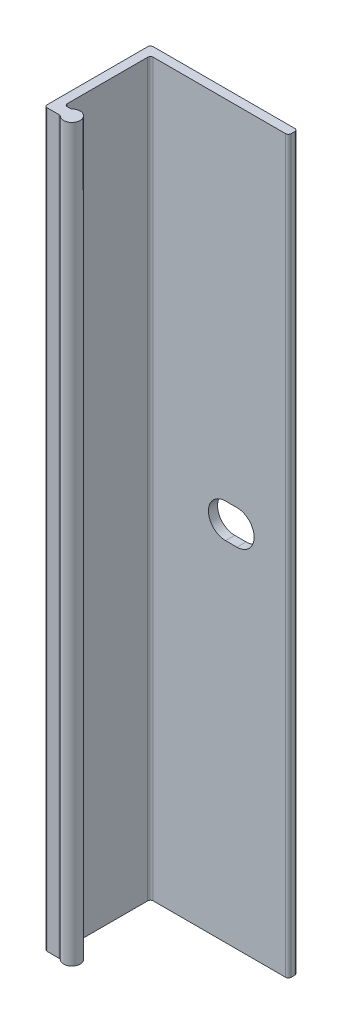
ISO-10303-21;
HEADER;
FILE_DESCRIPTION(('STEP AP214'),'2;1');
FILE_NAME('part.step','',(''),(''),'','','');
FILE_SCHEMA(('AUTOMOTIVE_DESIGN { 1 0 10303 214 1 1 1 1 }'));
ENDSEC;
DATA;
#1=APPLICATION_CONTEXT('core data for automotive mechanical design processes');
#2=APPLICATION_PROTOCOL_DEFINITION('international standard','automotive_design',2000,#1);
#3=PRODUCT_CONTEXT('',#1,'mechanical');
#4=PRODUCT('Part','Part','',(#3));
#5=PRODUCT_RELATED_PRODUCT_CATEGORY('part','',(#4));
#6=PRODUCT_DEFINITION_FORMATION('','',#4);
#7=PRODUCT_DEFINITION_CONTEXT('part definition',#1,'design');
#8=PRODUCT_DEFINITION('design','',#6,#7);
#9=PRODUCT_DEFINITION_SHAPE('','',#8);
#10=(LENGTH_UNIT() NAMED_UNIT(*) SI_UNIT(.MILLI.,.METRE.));
#11=(NAMED_UNIT(*) PLANE_ANGLE_UNIT() SI_UNIT($,.RADIAN.));
#12=(NAMED_UNIT(*) SI_UNIT($,.STERADIAN.) SOLID_ANGLE_UNIT());
#13=UNCERTAINTY_MEASURE_WITH_UNIT(LENGTH_MEASURE(1.E-05),#10,'distance_accuracy_value','');
#14=(GEOMETRIC_REPRESENTATION_CONTEXT(3) GLOBAL_UNCERTAINTY_ASSIGNED_CONTEXT((#13)) GLOBAL_UNIT_ASSIGNED_CONTEXT((#10,
#11,#12)) REPRESENTATION_CONTEXT('',''));
#15=CARTESIAN_POINT('',(0.,0.,0.));
#16=DIRECTION('',(0.,0.,1.));
#17=DIRECTION('',(1.,0.,0.));
#18=AXIS2_PLACEMENT_3D('',#15,#16,#17);
#19=CARTESIAN_POINT('',(0.381000000000002,50.8,14.351));
#20=DIRECTION('',(0.,-1.,0.));
#21=DIRECTION('',(0.,0.,-1.));
#22=AXIS2_PLACEMENT_3D('',#19,#20,#21);
#23=CYLINDRICAL_SURFACE('',#22,0.381);
#24=CARTESIAN_POINT('',(0.381000000000002,-50.8,14.351));
#25=DIRECTION('',(0.,1.,0.));
#26=DIRECTION('',(0.,0.,-1.));
#27=AXIS2_PLACEMENT_3D('',#24,#25,#26);
#28=CIRCLE('',#27,0.381);
#29=CARTESIAN_POINT('',(0.,-50.8,14.351));
#30=VERTEX_POINT('',#29);
#31=CARTESIAN_POINT('',(0.381000000000002,-50.8,14.732));
#32=VERTEX_POINT('',#31);
#33=EDGE_CURVE('E203',#30,#32,#28,.T.);
#34=ORIENTED_EDGE('',*,*,#33,.T.);
#35=DIRECTION('',(0.,-1.,0.));
#36=VECTOR('',#35,1.);
#37=CARTESIAN_POINT('',(0.381000000000002,50.8,14.732));
#38=LINE('',#37,#36);
#39=CARTESIAN_POINT('',(0.381000000000002,50.8,14.732));
#40=VERTEX_POINT('',#39);
#41=EDGE_CURVE('E11',#40,#32,#38,.T.);
#42=ORIENTED_EDGE('',*,*,#41,.F.);
#43=CARTESIAN_POINT('',(0.381000000000002,50.8,14.351));
#44=DIRECTION('',(0.,1.,0.));
#45=DIRECTION('',(0.,0.,-1.));
#46=AXIS2_PLACEMENT_3D('',#43,#44,#45);
#47=CIRCLE('',#46,0.381);
#48=CARTESIAN_POINT('',(0.,50.8,14.351));
#49=VERTEX_POINT('',#48);
#50=EDGE_CURVE('E207',#49,#40,#47,.T.);
#51=ORIENTED_EDGE('',*,*,#50,.F.);
#52=DIRECTION('',(0.,-1.,0.));
#53=VECTOR('',#52,1.);
#54=CARTESIAN_POINT('',(0.,50.8,14.351));
#55=LINE('',#54,#53);
#56=EDGE_CURVE('E241',#49,#30,#55,.T.);
#57=ORIENTED_EDGE('',*,*,#56,.T.);
#58=EDGE_LOOP('',(#34,#42,#51,#57));
#59=FACE_BOUND('',#58,.T.);
#60=ADVANCED_FACE('F34',(#59),#23,.T.);
#61=CARTESIAN_POINT('',(0.381000000000002,50.8,14.732));
#62=DIRECTION('',(0.,0.,-1.));
#63=DIRECTION('',(-1.,0.,0.));
#64=AXIS2_PLACEMENT_3D('',#61,#62,#63);
#65=PLANE('',#64);
#66=DIRECTION('',(1.,0.,0.));
#67=VECTOR('',#66,1.);
#68=CARTESIAN_POINT('',(0.381000000000002,-50.8,14.732));
#69=LINE('',#68,#67);
#70=CARTESIAN_POINT('',(2.03996875048439,-50.8,14.732));
#71=VERTEX_POINT('',#70);
#72=EDGE_CURVE('E244',#32,#71,#69,.T.);
#73=ORIENTED_EDGE('',*,*,#72,.T.);
#74=DIRECTION('',(0.,-1.,0.));
#75=VECTOR('',#74,1.);
#76=CARTESIAN_POINT('',(2.03996875048439,50.8,14.732));
#77=LINE('',#76,#75);
#78=CARTESIAN_POINT('',(2.03996875048439,50.8,14.732));
#79=VERTEX_POINT('',#78);
#80=EDGE_CURVE('E41',#79,#71,#77,.T.);
#81=ORIENTED_EDGE('',*,*,#80,.F.);
#82=DIRECTION('',(1.,0.,0.));
#83=VECTOR('',#82,1.);
#84=CARTESIAN_POINT('',(0.381000000000002,50.8,14.732));
#85=LINE('',#84,#83);
#86=EDGE_CURVE('E210',#40,#79,#85,.T.);
#87=ORIENTED_EDGE('',*,*,#86,.F.);
#88=ORIENTED_EDGE('',*,*,#41,.T.);
#89=EDGE_LOOP('',(#73,#81,#87,#88));
#90=FACE_BOUND('',#89,.T.);
#91=ADVANCED_FACE('F341',(#90),#65,.F.);
#92=CARTESIAN_POINT('',(2.03996875048439,50.8,15.113));
#93=DIRECTION('',(0.,-1.,0.));
#94=DIRECTION('',(0.,0.,-1.));
#95=AXIS2_PLACEMENT_3D('',#92,#93,#94);
#96=CYLINDRICAL_SURFACE('',#95,0.380999999999999);
#97=CARTESIAN_POINT('',(2.03996875048439,-50.8,15.113));
#98=DIRECTION('',(0.,-1.,0.));
#99=DIRECTION('',(0.,0.,-1.));
#100=AXIS2_PLACEMENT_3D('',#97,#98,#99);
#101=CIRCLE('',#100,0.380999999999999);
#102=CARTESIAN_POINT('',(2.29197656286329,-50.8,14.82725));
#103=VERTEX_POINT('',#102);
#104=EDGE_CURVE('E246',#71,#103,#101,.T.);
#105=ORIENTED_EDGE('',*,*,#104,.T.);
#106=DIRECTION('',(0.,-1.,0.));
#107=VECTOR('',#106,1.);
#108=CARTESIAN_POINT('',(2.29197656286329,50.8,14.82725));
#109=LINE('',#108,#107);
#110=CARTESIAN_POINT('',(2.29197656286329,50.8,14.82725));
#111=VERTEX_POINT('',#110);
#112=EDGE_CURVE('E311',#111,#103,#109,.T.);
#113=ORIENTED_EDGE('',*,*,#112,.F.);
#114=CARTESIAN_POINT('',(2.03996875048439,50.8,15.113));
#115=DIRECTION('',(0.,-1.,0.));
#116=DIRECTION('',(0.,0.,-1.));
#117=AXIS2_PLACEMENT_3D('',#114,#115,#116);
#118=CIRCLE('',#117,0.380999999999999);
#119=EDGE_CURVE('E213',#79,#111,#118,.T.);
#120=ORIENTED_EDGE('',*,*,#119,.F.);
#121=ORIENTED_EDGE('',*,*,#80,.T.);
#122=EDGE_LOOP('',(#105,#113,#120,#121));
#123=FACE_BOUND('',#122,.T.);
#124=ADVANCED_FACE('F318',(#123),#96,.F.);
#125=CARTESIAN_POINT('',(3.048,50.8,13.97));
#126=DIRECTION('',(0.,-1.,0.));
#127=DIRECTION('',(0.,0.,-1.));
#128=AXIS2_PLACEMENT_3D('',#125,#126,#127);
#129=CYLINDRICAL_SURFACE('',#128,1.143);
#130=CARTESIAN_POINT('',(3.048,-50.8,13.97));
#131=DIRECTION('',(0.,1.,0.));
#132=DIRECTION('',(0.,0.,1.));
#133=AXIS2_PLACEMENT_3D('',#130,#131,#132);
#134=CIRCLE('',#133,1.143);
#135=CARTESIAN_POINT('',(2.29197656286329,-50.8,13.11275));
#136=VERTEX_POINT('',#135);
#137=EDGE_CURVE('E248',#103,#136,#134,.T.);
#138=ORIENTED_EDGE('',*,*,#137,.T.);
#139=DIRECTION('',(0.,-1.,0.));
#140=VECTOR('',#139,1.);
#141=CARTESIAN_POINT('',(2.29197656286329,50.8,13.11275));
#142=LINE('',#141,#140);
#143=CARTESIAN_POINT('',(2.29197656286329,50.8,13.11275));
#144=VERTEX_POINT('',#143);
#145=EDGE_CURVE('E308',#144,#136,#142,.T.);
#146=ORIENTED_EDGE('',*,*,#145,.F.);
#147=CARTESIAN_POINT('',(3.048,50.8,13.97));
#148=DIRECTION('',(0.,1.,0.));
#149=DIRECTION('',(0.,0.,1.));
#150=AXIS2_PLACEMENT_3D('',#147,#148,#149);
#151=CIRCLE('',#150,1.143);
#152=EDGE_CURVE('E215',#111,#144,#151,.T.);
#153=ORIENTED_EDGE('',*,*,#152,.F.);
#154=ORIENTED_EDGE('',*,*,#112,.T.);
#155=EDGE_LOOP('',(#138,#146,#153,#154));
#156=FACE_BOUND('',#155,.T.);
#157=ADVANCED_FACE('F329',(#156),#129,.T.);
#158=CARTESIAN_POINT('',(2.03996875048439,50.8,12.827));
#159=DIRECTION('',(0.,-1.,0.));
#160=DIRECTION('',(0.,0.,-1.));
#161=AXIS2_PLACEMENT_3D('',#158,#159,#160);
#162=CYLINDRICAL_SURFACE('',#161,0.381000000000001);
#163=CARTESIAN_POINT('',(2.03996875048439,-50.8,12.827));
#164=DIRECTION('',(0.,-1.,0.));
#165=DIRECTION('',(0.,0.,-1.));
#166=AXIS2_PLACEMENT_3D('',#163,#164,#165);
#167=CIRCLE('',#166,0.381000000000001);
#168=CARTESIAN_POINT('',(2.03996875048439,-50.8,13.208));
#169=VERTEX_POINT('',#168);
#170=EDGE_CURVE('E250',#136,#169,#167,.T.);
#171=ORIENTED_EDGE('',*,*,#170,.T.);
#172=DIRECTION('',(0.,-1.,0.));
#173=VECTOR('',#172,1.);
#174=CARTESIAN_POINT('',(2.03996875048439,50.8,13.208));
#175=LINE('',#174,#173);
#176=CARTESIAN_POINT('',(2.03996875048439,50.8,13.208));
#177=VERTEX_POINT('',#176);
#178=EDGE_CURVE('E305',#177,#169,#175,.T.);
#179=ORIENTED_EDGE('',*,*,#178,.F.);
#180=CARTESIAN_POINT('',(2.03996875048439,50.8,12.827));
#181=DIRECTION('',(0.,-1.,0.));
#182=DIRECTION('',(0.,0.,-1.));
#183=AXIS2_PLACEMENT_3D('',#180,#181,#182);
#184=CIRCLE('',#183,0.381000000000001);
#185=EDGE_CURVE('E217',#144,#177,#184,.T.);
#186=ORIENTED_EDGE('',*,*,#185,.F.);
#187=ORIENTED_EDGE('',*,*,#145,.T.);
#188=EDGE_LOOP('',(#171,#179,#186,#187));
#189=FACE_BOUND('',#188,.T.);
#190=ADVANCED_FACE('F333',(#189),#162,.F.);
#191=CARTESIAN_POINT('',(1.65099999999999,50.8,13.208));
#192=DIRECTION('',(0.,0.,1.));
#193=DIRECTION('',(1.,0.,0.));
#194=AXIS2_PLACEMENT_3D('',#191,#192,#193);
#195=PLANE('',#194);
#196=DIRECTION('',(-1.,0.,0.));
#197=VECTOR('',#196,1.);
#198=CARTESIAN_POINT('',(1.65099999999999,-50.8,13.208));
#199=LINE('',#198,#197);
#200=CARTESIAN_POINT('',(1.65099999999999,-50.8,13.208));
#201=VERTEX_POINT('',#200);
#202=EDGE_CURVE('E252',#169,#201,#199,.T.);
#203=ORIENTED_EDGE('',*,*,#202,.T.);
#204=DIRECTION('',(0.,-1.,0.));
#205=VECTOR('',#204,1.);
#206=CARTESIAN_POINT('',(1.65099999999999,50.8,13.208));
#207=LINE('',#206,#205);
#208=CARTESIAN_POINT('',(1.65099999999999,50.8,13.208));
#209=VERTEX_POINT('',#208);
#210=EDGE_CURVE('E302',#209,#201,#207,.T.);
#211=ORIENTED_EDGE('',*,*,#210,.F.);
#212=DIRECTION('',(-1.,0.,0.));
#213=VECTOR('',#212,1.);
#214=CARTESIAN_POINT('',(1.65099999999999,50.8,13.208));
#215=LINE('',#214,#213);
#216=EDGE_CURVE('E219',#177,#209,#215,.T.);
#217=ORIENTED_EDGE('',*,*,#216,.F.);
#218=ORIENTED_EDGE('',*,*,#178,.T.);
#219=EDGE_LOOP('',(#203,#211,#217,#218));
#220=FACE_BOUND('',#219,.T.);
#221=ADVANCED_FACE('F392',(#220),#195,.F.);
#222=CARTESIAN_POINT('',(1.65099999999999,50.8,12.827));
#223=DIRECTION('',(0.,-1.,0.));
#224=DIRECTION('',(0.,0.,-1.));
#225=AXIS2_PLACEMENT_3D('',#222,#223,#224);
#226=CYLINDRICAL_SURFACE('',#225,0.381);
#227=CARTESIAN_POINT('',(1.65099999999999,-50.8,12.827));
#228=DIRECTION('',(0.,-1.,0.));
#229=DIRECTION('',(0.,0.,1.));
#230=AXIS2_PLACEMENT_3D('',#227,#228,#229);
#231=CIRCLE('',#230,0.381);
#232=CARTESIAN_POINT('',(1.26999999999999,-50.8,12.827));
#233=VERTEX_POINT('',#232);
#234=EDGE_CURVE('E254',#201,#233,#231,.T.);
#235=ORIENTED_EDGE('',*,*,#234,.T.);
#236=DIRECTION('',(0.,-1.,0.));
#237=VECTOR('',#236,1.);
#238=CARTESIAN_POINT('',(1.26999999999999,50.8,12.827));
#239=LINE('',#238,#237);
#240=CARTESIAN_POINT('',(1.26999999999999,50.8,12.827));
#241=VERTEX_POINT('',#240);
#242=EDGE_CURVE('E299',#241,#233,#239,.T.);
#243=ORIENTED_EDGE('',*,*,#242,.F.);
#244=CARTESIAN_POINT('',(1.65099999999999,50.8,12.827));
#245=DIRECTION('',(0.,-1.,0.));
#246=DIRECTION('',(0.,0.,1.));
#247=AXIS2_PLACEMENT_3D('',#244,#245,#246);
#248=CIRCLE('',#247,0.381);
#249=EDGE_CURVE('E221',#209,#241,#248,.T.);
#250=ORIENTED_EDGE('',*,*,#249,.F.);
#251=ORIENTED_EDGE('',*,*,#210,.T.);
#252=EDGE_LOOP('',(#235,#243,#250,#251));
#253=FACE_BOUND('',#252,.T.);
#254=ADVANCED_FACE('F389',(#253),#226,.F.);
#255=CARTESIAN_POINT('',(1.27,50.8,1.651));
#256=DIRECTION('',(-1.,0.,0.));
#257=DIRECTION('',(0.,0.,1.));
#258=AXIS2_PLACEMENT_3D('',#255,#256,#257);
#259=PLANE('',#258);
#260=DIRECTION('',(0.,0.,-1.));
#261=VECTOR('',#260,1.);
#262=CARTESIAN_POINT('',(1.27,-50.8,1.651));
#263=LINE('',#262,#261);
#264=CARTESIAN_POINT('',(1.27,-50.8,1.651));
#265=VERTEX_POINT('',#264);
#266=EDGE_CURVE('E256',#233,#265,#263,.T.);
#267=ORIENTED_EDGE('',*,*,#266,.T.);
#268=DIRECTION('',(0.,-1.,0.));
#269=VECTOR('',#268,1.);
#270=CARTESIAN_POINT('',(1.27,50.8,1.651));
#271=LINE('',#270,#269);
#272=CARTESIAN_POINT('',(1.27,50.8,1.651));
#273=VERTEX_POINT('',#272);
#274=EDGE_CURVE('E296',#273,#265,#271,.T.);
#275=ORIENTED_EDGE('',*,*,#274,.F.);
#276=DIRECTION('',(0.,0.,-1.));
#277=VECTOR('',#276,1.);
#278=CARTESIAN_POINT('',(1.27,50.8,1.651));
#279=LINE('',#278,#277);
#280=EDGE_CURVE('E223',#241,#273,#279,.T.);
#281=ORIENTED_EDGE('',*,*,#280,.F.);
#282=ORIENTED_EDGE('',*,*,#242,.T.);
#283=EDGE_LOOP('',(#267,#275,#281,#282));
#284=FACE_BOUND('',#283,.T.);
#285=ADVANCED_FACE('F385',(#284),#259,.F.);
#286=CARTESIAN_POINT('',(1.651,50.8,1.651));
#287=DIRECTION('',(0.,-1.,0.));
#288=DIRECTION('',(0.,0.,-1.));
#289=AXIS2_PLACEMENT_3D('',#286,#287,#288);
#290=CYLINDRICAL_SURFACE('',#289,0.381);
#291=CARTESIAN_POINT('',(1.651,-50.8,1.651));
#292=DIRECTION('',(0.,-1.,0.));
#293=DIRECTION('',(0.,0.,1.));
#294=AXIS2_PLACEMENT_3D('',#291,#292,#293);
#295=CIRCLE('',#294,0.381);
#296=CARTESIAN_POINT('',(1.651,-50.8,1.27));
#297=VERTEX_POINT('',#296);
#298=EDGE_CURVE('E258',#265,#297,#295,.T.);
#299=ORIENTED_EDGE('',*,*,#298,.T.);
#300=DIRECTION('',(0.,-1.,0.));
#301=VECTOR('',#300,1.);
#302=CARTESIAN_POINT('',(1.651,50.8,1.27));
#303=LINE('',#302,#301);
#304=CARTESIAN_POINT('',(1.651,50.8,1.27));
#305=VERTEX_POINT('',#304);
#306=EDGE_CURVE('E293',#305,#297,#303,.T.);
#307=ORIENTED_EDGE('',*,*,#306,.F.);
#308=CARTESIAN_POINT('',(1.651,50.8,1.651));
#309=DIRECTION('',(0.,-1.,0.));
#310=DIRECTION('',(0.,0.,1.));
#311=AXIS2_PLACEMENT_3D('',#308,#309,#310);
#312=CIRCLE('',#311,0.381);
#313=EDGE_CURVE('E225',#273,#305,#312,.T.);
#314=ORIENTED_EDGE('',*,*,#313,.F.);
#315=ORIENTED_EDGE('',*,*,#274,.T.);
#316=EDGE_LOOP('',(#299,#307,#314,#315));
#317=FACE_BOUND('',#316,.T.);
#318=ADVANCED_FACE('F381',(#317),#290,.F.);
#319=CARTESIAN_POINT('',(20.066,50.8,1.27));
#320=DIRECTION('',(0.,0.,-1.));
#321=DIRECTION('',(-1.,0.,0.));
#322=AXIS2_PLACEMENT_3D('',#319,#320,#321);
#323=PLANE('',#322);
#324=DIRECTION('',(1.,0.,0.));
#325=VECTOR('',#324,1.);
#326=CARTESIAN_POINT('',(11.71575,-2.38125,1.27));
#327=LINE('',#326,#325);
#328=CARTESIAN_POINT('',(11.71575,-2.38125,1.27));
#329=VERTEX_POINT('',#328);
#330=CARTESIAN_POINT('',(13.30325,-2.38125,1.27));
#331=VERTEX_POINT('',#330);
#332=EDGE_CURVE('E197',#329,#331,#327,.T.);
#333=ORIENTED_EDGE('',*,*,#332,.F.);
#334=CARTESIAN_POINT('',(11.71575,0.,1.27));
#335=DIRECTION('',(0.,0.,1.));
#336=DIRECTION('',(1.,0.,0.));
#337=AXIS2_PLACEMENT_3D('',#334,#335,#336);
#338=CIRCLE('',#337,2.38125);
#339=CARTESIAN_POINT('',(11.71575,2.38125,1.27));
#340=VERTEX_POINT('',#339);
#341=EDGE_CURVE('E48',#340,#329,#338,.T.);
#342=ORIENTED_EDGE('',*,*,#341,.F.);
#343=DIRECTION('',(-1.,0.,0.));
#344=VECTOR('',#343,1.);
#345=CARTESIAN_POINT('',(11.71575,2.38125,1.27));
#346=LINE('',#345,#344);
#347=CARTESIAN_POINT('',(13.30325,2.38125,1.27));
#348=VERTEX_POINT('',#347);
#349=EDGE_CURVE('E188',#348,#340,#346,.T.);
#350=ORIENTED_EDGE('',*,*,#349,.F.);
#351=CARTESIAN_POINT('',(13.30325,0.,1.27));
#352=DIRECTION('',(0.,0.,1.));
#353=DIRECTION('',(1.,0.,0.));
#354=AXIS2_PLACEMENT_3D('',#351,#352,#353);
#355=CIRCLE('',#354,2.38125);
#356=EDGE_CURVE('E191',#331,#348,#355,.T.);
#357=ORIENTED_EDGE('',*,*,#356,.F.);
#358=EDGE_LOOP('',(#333,#342,#350,#357));
#359=FACE_BOUND('',#358,.T.);
#360=DIRECTION('',(1.,0.,0.));
#361=VECTOR('',#360,1.);
#362=CARTESIAN_POINT('',(20.066,-50.8,1.27));
#363=LINE('',#362,#361);
#364=CARTESIAN_POINT('',(20.066,-50.8,1.27));
#365=VERTEX_POINT('',#364);
#366=EDGE_CURVE('E260',#297,#365,#363,.T.);
#367=ORIENTED_EDGE('',*,*,#366,.T.);
#368=DIRECTION('',(0.,-1.,0.));
#369=VECTOR('',#368,1.);
#370=CARTESIAN_POINT('',(20.066,50.8,1.27));
#371=LINE('',#370,#369);
#372=CARTESIAN_POINT('',(20.066,50.8,1.27));
#373=VERTEX_POINT('',#372);
#374=EDGE_CURVE('E290',#373,#365,#371,.T.);
#375=ORIENTED_EDGE('',*,*,#374,.F.);
#376=DIRECTION('',(1.,0.,0.));
#377=VECTOR('',#376,1.);
#378=CARTESIAN_POINT('',(20.066,50.8,1.27));
#379=LINE('',#378,#377);
#380=EDGE_CURVE('E227',#305,#373,#379,.T.);
#381=ORIENTED_EDGE('',*,*,#380,.F.);
#382=ORIENTED_EDGE('',*,*,#306,.T.);
#383=EDGE_LOOP('',(#367,#375,#381,#382));
#384=FACE_BOUND('',#383,.T.);
#385=ADVANCED_FACE('F376',(#359,#384),#323,.F.);
#386=CARTESIAN_POINT('',(20.066,50.8,0.889));
#387=DIRECTION('',(0.,-1.,0.));
#388=DIRECTION('',(0.,0.,-1.));
#389=AXIS2_PLACEMENT_3D('',#386,#387,#388);
#390=CYLINDRICAL_SURFACE('',#389,0.380999999999999);
#391=CARTESIAN_POINT('',(20.066,-50.8,0.889));
#392=DIRECTION('',(0.,1.,0.));
#393=DIRECTION('',(0.,0.,-1.));
#394=AXIS2_PLACEMENT_3D('',#391,#392,#393);
#395=CIRCLE('',#394,0.380999999999999);
#396=CARTESIAN_POINT('',(20.447,-50.8,0.889));
#397=VERTEX_POINT('',#396);
#398=EDGE_CURVE('E262',#365,#397,#395,.T.);
#399=ORIENTED_EDGE('',*,*,#398,.T.);
#400=DIRECTION('',(0.,-1.,0.));
#401=VECTOR('',#400,1.);
#402=CARTESIAN_POINT('',(20.447,50.8,0.889));
#403=LINE('',#402,#401);
#404=CARTESIAN_POINT('',(20.447,50.8,0.889));
#405=VERTEX_POINT('',#404);
#406=EDGE_CURVE('E287',#405,#397,#403,.T.);
#407=ORIENTED_EDGE('',*,*,#406,.F.);
#408=CARTESIAN_POINT('',(20.066,50.8,0.889));
#409=DIRECTION('',(0.,1.,0.));
#410=DIRECTION('',(0.,0.,-1.));
#411=AXIS2_PLACEMENT_3D('',#408,#409,#410);
#412=CIRCLE('',#411,0.380999999999999);
#413=EDGE_CURVE('E229',#373,#405,#412,.T.);
#414=ORIENTED_EDGE('',*,*,#413,.F.);
#415=ORIENTED_EDGE('',*,*,#374,.T.);
#416=EDGE_LOOP('',(#399,#407,#414,#415));
#417=FACE_BOUND('',#416,.T.);
#418=ADVANCED_FACE('F370',(#417),#390,.T.);
#419=CARTESIAN_POINT('',(20.447,50.8,0.381));
#420=DIRECTION('',(-1.,0.,0.));
#421=DIRECTION('',(0.,0.,1.));
#422=AXIS2_PLACEMENT_3D('',#419,#420,#421);
#423=PLANE('',#422);
#424=DIRECTION('',(0.,0.,-1.));
#425=VECTOR('',#424,1.);
#426=CARTESIAN_POINT('',(20.447,-50.8,0.381));
#427=LINE('',#426,#425);
#428=CARTESIAN_POINT('',(20.447,-50.8,0.381));
#429=VERTEX_POINT('',#428);
#430=EDGE_CURVE('E264',#397,#429,#427,.T.);
#431=ORIENTED_EDGE('',*,*,#430,.T.);
#432=DIRECTION('',(0.,-1.,0.));
#433=VECTOR('',#432,1.);
#434=CARTESIAN_POINT('',(20.447,50.8,0.381));
#435=LINE('',#434,#433);
#436=CARTESIAN_POINT('',(20.447,50.8,0.381));
#437=VERTEX_POINT('',#436);
#438=EDGE_CURVE('E284',#437,#429,#435,.T.);
#439=ORIENTED_EDGE('',*,*,#438,.F.);
#440=DIRECTION('',(0.,0.,-1.));
#441=VECTOR('',#440,1.);
#442=CARTESIAN_POINT('',(20.447,50.8,0.381));
#443=LINE('',#442,#441);
#444=EDGE_CURVE('E231',#405,#437,#443,.T.);
#445=ORIENTED_EDGE('',*,*,#444,.F.);
#446=ORIENTED_EDGE('',*,*,#406,.T.);
#447=EDGE_LOOP('',(#431,#439,#445,#446));
#448=FACE_BOUND('',#447,.T.);
#449=ADVANCED_FACE('F366',(#448),#423,.F.);
#450=CARTESIAN_POINT('',(20.066,50.8,0.381));
#451=DIRECTION('',(0.,-1.,0.));
#452=DIRECTION('',(0.,0.,-1.));
#453=AXIS2_PLACEMENT_3D('',#450,#451,#452);
#454=CYLINDRICAL_SURFACE('',#453,0.381);
#455=CARTESIAN_POINT('',(20.066,-50.8,0.381));
#456=DIRECTION('',(0.,1.,0.));
#457=DIRECTION('',(0.,0.,-1.));
#458=AXIS2_PLACEMENT_3D('',#455,#456,#457);
#459=CIRCLE('',#458,0.381);
#460=CARTESIAN_POINT('',(20.066,-50.8,0.));
#461=VERTEX_POINT('',#460);
#462=EDGE_CURVE('E266',#429,#461,#459,.T.);
#463=ORIENTED_EDGE('',*,*,#462,.T.);
#464=DIRECTION('',(0.,-1.,0.));
#465=VECTOR('',#464,1.);
#466=CARTESIAN_POINT('',(20.066,50.8,0.));
#467=LINE('',#466,#465);
#468=CARTESIAN_POINT('',(20.066,50.8,0.));
#469=VERTEX_POINT('',#468);
#470=EDGE_CURVE('E281',#469,#461,#467,.T.);
#471=ORIENTED_EDGE('',*,*,#470,.F.);
#472=CARTESIAN_POINT('',(20.066,50.8,0.381));
#473=DIRECTION('',(0.,1.,0.));
#474=DIRECTION('',(0.,0.,-1.));
#475=AXIS2_PLACEMENT_3D('',#472,#473,#474);
#476=CIRCLE('',#475,0.381);
#477=EDGE_CURVE('E233',#437,#469,#476,.T.);
#478=ORIENTED_EDGE('',*,*,#477,.F.);
#479=ORIENTED_EDGE('',*,*,#438,.T.);
#480=EDGE_LOOP('',(#463,#471,#478,#479));
#481=FACE_BOUND('',#480,.T.);
#482=ADVANCED_FACE('F361',(#481),#454,.T.);
#483=CARTESIAN_POINT('',(0.381000000000003,50.8,0.));
#484=DIRECTION('',(0.,0.,1.));
#485=DIRECTION('',(1.,0.,0.));
#486=AXIS2_PLACEMENT_3D('',#483,#484,#485);
#487=PLANE('',#486);
#488=DIRECTION('',(-1.,0.,0.));
#489=VECTOR('',#488,1.);
#490=CARTESIAN_POINT('',(11.71575,2.38125,0.));
#491=LINE('',#490,#489);
#492=CARTESIAN_POINT('',(13.30325,2.38125,0.));
#493=VERTEX_POINT('',#492);
#494=CARTESIAN_POINT('',(11.71575,2.38125,0.));
#495=VERTEX_POINT('',#494);
#496=EDGE_CURVE('E178',#493,#495,#491,.T.);
#497=ORIENTED_EDGE('',*,*,#496,.T.);
#498=CARTESIAN_POINT('',(11.71575,0.,0.));
#499=DIRECTION('',(0.,0.,1.));
#500=DIRECTION('',(1.,0.,0.));
#501=AXIS2_PLACEMENT_3D('',#498,#499,#500);
#502=CIRCLE('',#501,2.38125);
#503=CARTESIAN_POINT('',(11.71575,-2.38125,0.));
#504=VERTEX_POINT('',#503);
#505=EDGE_CURVE('E172',#495,#504,#502,.T.);
#506=ORIENTED_EDGE('',*,*,#505,.T.);
#507=DIRECTION('',(1.,0.,0.));
#508=VECTOR('',#507,1.);
#509=CARTESIAN_POINT('',(11.71575,-2.38125,0.));
#510=LINE('',#509,#508);
#511=CARTESIAN_POINT('',(13.30325,-2.38125,0.));
#512=VERTEX_POINT('',#511);
#513=EDGE_CURVE('E181',#504,#512,#510,.T.);
#514=ORIENTED_EDGE('',*,*,#513,.T.);
#515=CARTESIAN_POINT('',(13.30325,0.,0.));
#516=DIRECTION('',(0.,0.,1.));
#517=DIRECTION('',(1.,0.,0.));
#518=AXIS2_PLACEMENT_3D('',#515,#516,#517);
#519=CIRCLE('',#518,2.38125);
#520=EDGE_CURVE('E56',#512,#493,#519,.T.);
#521=ORIENTED_EDGE('',*,*,#520,.T.);
#522=EDGE_LOOP('',(#497,#506,#514,#521));
#523=FACE_BOUND('',#522,.T.);
#524=DIRECTION('',(-1.,0.,0.));
#525=VECTOR('',#524,1.);
#526=CARTESIAN_POINT('',(0.381000000000003,-50.8,0.));
#527=LINE('',#526,#525);
#528=CARTESIAN_POINT('',(0.381000000000003,-50.8,0.));
#529=VERTEX_POINT('',#528);
#530=EDGE_CURVE('E268',#461,#529,#527,.T.);
#531=ORIENTED_EDGE('',*,*,#530,.T.);
#532=DIRECTION('',(0.,-1.,0.));
#533=VECTOR('',#532,1.);
#534=CARTESIAN_POINT('',(0.381000000000003,50.8,0.));
#535=LINE('',#534,#533);
#536=CARTESIAN_POINT('',(0.381000000000003,50.8,0.));
#537=VERTEX_POINT('',#536);
#538=EDGE_CURVE('E278',#537,#529,#535,.T.);
#539=ORIENTED_EDGE('',*,*,#538,.F.);
#540=DIRECTION('',(-1.,0.,0.));
#541=VECTOR('',#540,1.);
#542=CARTESIAN_POINT('',(0.381000000000003,50.8,0.));
#543=LINE('',#542,#541);
#544=EDGE_CURVE('E235',#469,#537,#543,.T.);
#545=ORIENTED_EDGE('',*,*,#544,.F.);
#546=ORIENTED_EDGE('',*,*,#470,.T.);
#547=EDGE_LOOP('',(#531,#539,#545,#546));
#548=FACE_BOUND('',#547,.T.);
#549=ADVANCED_FACE('F185',(#523,#548),#487,.F.);
#550=CARTESIAN_POINT('',(0.381,50.8,0.381));
#551=DIRECTION('',(0.,-1.,0.));
#552=DIRECTION('',(0.,0.,-1.));
#553=AXIS2_PLACEMENT_3D('',#550,#551,#552);
#554=CYLINDRICAL_SURFACE('',#553,0.381);
#555=CARTESIAN_POINT('',(0.381,-50.8,0.381));
#556=DIRECTION('',(0.,1.,0.));
#557=DIRECTION('',(0.,0.,1.));
#558=AXIS2_PLACEMENT_3D('',#555,#556,#557);
#559=CIRCLE('',#558,0.381);
#560=CARTESIAN_POINT('',(0.,-50.8,0.381000000000003));
#561=VERTEX_POINT('',#560);
#562=EDGE_CURVE('E270',#529,#561,#559,.T.);
#563=ORIENTED_EDGE('',*,*,#562,.T.);
#564=DIRECTION('',(0.,-1.,0.));
#565=VECTOR('',#564,1.);
#566=CARTESIAN_POINT('',(0.,50.8,0.381000000000003));
#567=LINE('',#566,#565);
#568=CARTESIAN_POINT('',(0.,50.8,0.381000000000003));
#569=VERTEX_POINT('',#568);
#570=EDGE_CURVE('E275',#569,#561,#567,.T.);
#571=ORIENTED_EDGE('',*,*,#570,.F.);
#572=CARTESIAN_POINT('',(0.381,50.8,0.381));
#573=DIRECTION('',(0.,1.,0.));
#574=DIRECTION('',(0.,0.,1.));
#575=AXIS2_PLACEMENT_3D('',#572,#573,#574);
#576=CIRCLE('',#575,0.381);
#577=EDGE_CURVE('E237',#537,#569,#576,.T.);
#578=ORIENTED_EDGE('',*,*,#577,.F.);
#579=ORIENTED_EDGE('',*,*,#538,.T.);
#580=EDGE_LOOP('',(#563,#571,#578,#579));
#581=FACE_BOUND('',#580,.T.);
#582=ADVANCED_FACE('F353',(#581),#554,.T.);
#583=CARTESIAN_POINT('',(0.,50.8,0.381000000000003));
#584=DIRECTION('',(1.,0.,0.));
#585=DIRECTION('',(0.,0.,-1.));
#586=AXIS2_PLACEMENT_3D('',#583,#584,#585);
#587=PLANE('',#586);
#588=DIRECTION('',(0.,0.,1.));
#589=VECTOR('',#588,1.);
#590=CARTESIAN_POINT('',(0.,-50.8,0.381000000000003));
#591=LINE('',#590,#589);
#592=EDGE_CURVE('E211',#561,#30,#591,.T.);
#593=ORIENTED_EDGE('',*,*,#592,.T.);
#594=ORIENTED_EDGE('',*,*,#56,.F.);
#595=DIRECTION('',(0.,0.,1.));
#596=VECTOR('',#595,1.);
#597=CARTESIAN_POINT('',(0.,50.8,0.381000000000003));
#598=LINE('',#597,#596);
#599=EDGE_CURVE('E239',#569,#49,#598,.T.);
#600=ORIENTED_EDGE('',*,*,#599,.F.);
#601=ORIENTED_EDGE('',*,*,#570,.T.);
#602=EDGE_LOOP('',(#593,#594,#600,#601));
#603=FACE_BOUND('',#602,.T.);
#604=ADVANCED_FACE('F348',(#603),#587,.F.);
#605=CARTESIAN_POINT('',(0.381000000000002,50.8,14.351));
#606=DIRECTION('',(0.,-1.,0.));
#607=DIRECTION('',(0.,0.,-1.));
#608=AXIS2_PLACEMENT_3D('',#605,#606,#607);
#609=PLANE('',#608);
#610=ORIENTED_EDGE('',*,*,#50,.T.);
#611=ORIENTED_EDGE('',*,*,#86,.T.);
#612=ORIENTED_EDGE('',*,*,#119,.T.);
#613=ORIENTED_EDGE('',*,*,#152,.T.);
#614=ORIENTED_EDGE('',*,*,#185,.T.);
#615=ORIENTED_EDGE('',*,*,#216,.T.);
#616=ORIENTED_EDGE('',*,*,#249,.T.);
#617=ORIENTED_EDGE('',*,*,#280,.T.);
#618=ORIENTED_EDGE('',*,*,#313,.T.);
#619=ORIENTED_EDGE('',*,*,#380,.T.);
#620=ORIENTED_EDGE('',*,*,#413,.T.);
#621=ORIENTED_EDGE('',*,*,#444,.T.);
#622=ORIENTED_EDGE('',*,*,#477,.T.);
#623=ORIENTED_EDGE('',*,*,#544,.T.);
#624=ORIENTED_EDGE('',*,*,#577,.T.);
#625=ORIENTED_EDGE('',*,*,#599,.T.);
#626=EDGE_LOOP('',(#610,#611,#612,#613,#614,#615,#616,#617,#618,#619,#620,#621,#622,#623,#624,#625));
#627=FACE_BOUND('',#626,.T.);
#628=ADVANCED_FACE('F337',(#627),#609,.F.);
#629=CARTESIAN_POINT('',(0.381000000000002,-50.8,14.351));
#630=DIRECTION('',(0.,-1.,0.));
#631=DIRECTION('',(0.,0.,-1.));
#632=AXIS2_PLACEMENT_3D('',#629,#630,#631);
#633=PLANE('',#632);
#634=ORIENTED_EDGE('',*,*,#33,.F.);
#635=ORIENTED_EDGE('',*,*,#592,.F.);
#636=ORIENTED_EDGE('',*,*,#562,.F.);
#637=ORIENTED_EDGE('',*,*,#530,.F.);
#638=ORIENTED_EDGE('',*,*,#462,.F.);
#639=ORIENTED_EDGE('',*,*,#430,.F.);
#640=ORIENTED_EDGE('',*,*,#398,.F.);
#641=ORIENTED_EDGE('',*,*,#366,.F.);
#642=ORIENTED_EDGE('',*,*,#298,.F.);
#643=ORIENTED_EDGE('',*,*,#266,.F.);
#644=ORIENTED_EDGE('',*,*,#234,.F.);
#645=ORIENTED_EDGE('',*,*,#202,.F.);
#646=ORIENTED_EDGE('',*,*,#170,.F.);
#647=ORIENTED_EDGE('',*,*,#137,.F.);
#648=ORIENTED_EDGE('',*,*,#104,.F.);
#649=ORIENTED_EDGE('',*,*,#72,.F.);
#650=EDGE_LOOP('',(#634,#635,#636,#637,#638,#639,#640,#641,#642,#643,#644,#645,#646,#647,#648,#649));
#651=FACE_BOUND('',#650,.T.);
#652=ADVANCED_FACE('F324',(#651),#633,.T.);
#653=CARTESIAN_POINT('',(11.71575,0.,0.));
#654=DIRECTION('',(0.,0.,1.));
#655=DIRECTION('',(1.,0.,0.));
#656=AXIS2_PLACEMENT_3D('',#653,#654,#655);
#657=CYLINDRICAL_SURFACE('',#656,2.38125);
#658=ORIENTED_EDGE('',*,*,#341,.T.);
#659=DIRECTION('',(0.,0.,1.));
#660=VECTOR('',#659,1.);
#661=CARTESIAN_POINT('',(11.71575,-2.38125,0.));
#662=LINE('',#661,#660);
#663=EDGE_CURVE('E168',#504,#329,#662,.T.);
#664=ORIENTED_EDGE('',*,*,#663,.F.);
#665=ORIENTED_EDGE('',*,*,#505,.F.);
#666=DIRECTION('',(0.,0.,1.));
#667=VECTOR('',#666,1.);
#668=CARTESIAN_POINT('',(11.71575,2.38125,0.));
#669=LINE('',#668,#667);
#670=EDGE_CURVE('E201',#495,#340,#669,.T.);
#671=ORIENTED_EDGE('',*,*,#670,.T.);
#672=EDGE_LOOP('',(#658,#664,#665,#671));
#673=FACE_BOUND('',#672,.T.);
#674=ADVANCED_FACE('F170',(#673),#657,.F.);
#675=CARTESIAN_POINT('',(11.71575,2.38125,0.));
#676=DIRECTION('',(0.,1.,0.));
#677=DIRECTION('',(-1.,0.,0.));
#678=AXIS2_PLACEMENT_3D('',#675,#676,#677);
#679=PLANE('',#678);
#680=ORIENTED_EDGE('',*,*,#349,.T.);
#681=ORIENTED_EDGE('',*,*,#670,.F.);
#682=ORIENTED_EDGE('',*,*,#496,.F.);
#683=DIRECTION('',(0.,0.,1.));
#684=VECTOR('',#683,1.);
#685=CARTESIAN_POINT('',(13.30325,2.38125,0.));
#686=LINE('',#685,#684);
#687=EDGE_CURVE('E204',#493,#348,#686,.T.);
#688=ORIENTED_EDGE('',*,*,#687,.T.);
#689=EDGE_LOOP('',(#680,#681,#682,#688));
#690=FACE_BOUND('',#689,.T.);
#691=ADVANCED_FACE('F527',(#690),#679,.F.);
#692=CARTESIAN_POINT('',(13.30325,0.,0.));
#693=DIRECTION('',(0.,0.,1.));
#694=DIRECTION('',(1.,0.,0.));
#695=AXIS2_PLACEMENT_3D('',#692,#693,#694);
#696=CYLINDRICAL_SURFACE('',#695,2.38125);
#697=ORIENTED_EDGE('',*,*,#356,.T.);
#698=ORIENTED_EDGE('',*,*,#687,.F.);
#699=ORIENTED_EDGE('',*,*,#520,.F.);
#700=DIRECTION('',(0.,0.,1.));
#701=VECTOR('',#700,1.);
#702=CARTESIAN_POINT('',(13.30325,-2.38125,0.));
#703=LINE('',#702,#701);
#704=EDGE_CURVE('E177',#512,#331,#703,.T.);
#705=ORIENTED_EDGE('',*,*,#704,.T.);
#706=EDGE_LOOP('',(#697,#698,#699,#705));
#707=FACE_BOUND('',#706,.T.);
#708=ADVANCED_FACE('F536',(#707),#696,.F.);
#709=CARTESIAN_POINT('',(11.71575,-2.38125,0.));
#710=DIRECTION('',(0.,-1.,0.));
#711=DIRECTION('',(1.,0.,0.));
#712=AXIS2_PLACEMENT_3D('',#709,#710,#711);
#713=PLANE('',#712);
#714=ORIENTED_EDGE('',*,*,#332,.T.);
#715=ORIENTED_EDGE('',*,*,#704,.F.);
#716=ORIENTED_EDGE('',*,*,#513,.F.);
#717=ORIENTED_EDGE('',*,*,#663,.T.);
#718=EDGE_LOOP('',(#714,#715,#716,#717));
#719=FACE_BOUND('',#718,.T.);
#720=ADVANCED_FACE('F182',(#719),#713,.F.);
#721=CLOSED_SHELL('',(#60,#91,#124,#157,#190,#221,#254,#285,#318,#385,#418,#449,#482,#549,#582,
#604,#628,#652,#674,#691,#708,#720));
#722=MANIFOLD_SOLID_BREP('B2',#721);
#723=ADVANCED_BREP_SHAPE_REPRESENTATION('',(#18,#722),#14);
#724=SHAPE_DEFINITION_REPRESENTATION(#9,#723);
ENDSEC;
END-ISO-10303-21;
